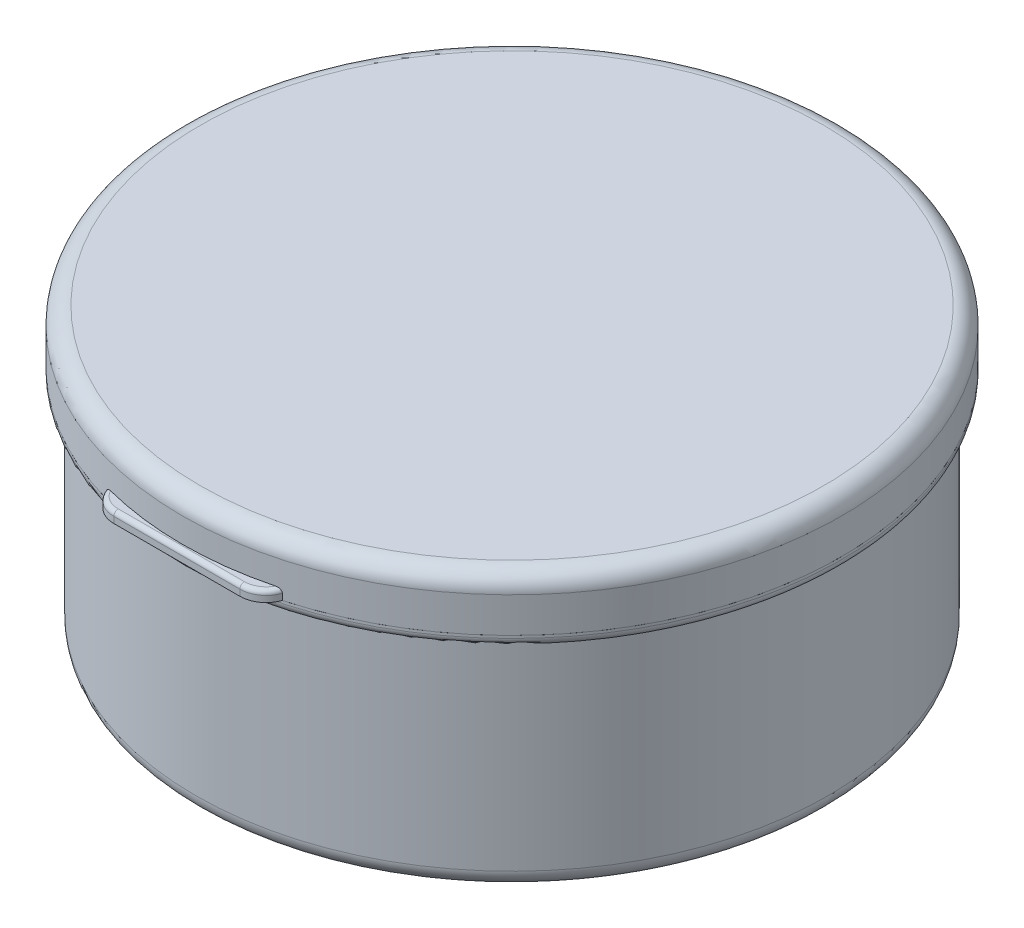
ISO-10303-21;
HEADER;
FILE_DESCRIPTION(('STEP AP214'),'2;1');
FILE_NAME('part.step','',(''),(''),'','','');
FILE_SCHEMA(('AUTOMOTIVE_DESIGN { 1 0 10303 214 1 1 1 1 }'));
ENDSEC;
DATA;
#1=APPLICATION_CONTEXT('core data for automotive mechanical design processes');
#2=APPLICATION_PROTOCOL_DEFINITION('international standard','automotive_design',2000,#1);
#3=PRODUCT_CONTEXT('',#1,'mechanical');
#4=PRODUCT('Part','Part','',(#3));
#5=PRODUCT_RELATED_PRODUCT_CATEGORY('part','',(#4));
#6=PRODUCT_DEFINITION_FORMATION('','',#4);
#7=PRODUCT_DEFINITION_CONTEXT('part definition',#1,'design');
#8=PRODUCT_DEFINITION('design','',#6,#7);
#9=PRODUCT_DEFINITION_SHAPE('','',#8);
#10=(LENGTH_UNIT() NAMED_UNIT(*) SI_UNIT(.MILLI.,.METRE.));
#11=(NAMED_UNIT(*) PLANE_ANGLE_UNIT() SI_UNIT($,.RADIAN.));
#12=(NAMED_UNIT(*) SI_UNIT($,.STERADIAN.) SOLID_ANGLE_UNIT());
#13=UNCERTAINTY_MEASURE_WITH_UNIT(LENGTH_MEASURE(1.E-05),#10,'distance_accuracy_value','');
#14=(GEOMETRIC_REPRESENTATION_CONTEXT(3) GLOBAL_UNCERTAINTY_ASSIGNED_CONTEXT((#13)) GLOBAL_UNIT_ASSIGNED_CONTEXT((#10,
#11,#12)) REPRESENTATION_CONTEXT('',''));
#15=CARTESIAN_POINT('',(0.,0.,0.));
#16=DIRECTION('',(0.,0.,1.));
#17=DIRECTION('',(1.,0.,0.));
#18=AXIS2_PLACEMENT_3D('',#15,#16,#17);
#19=CARTESIAN_POINT('',(0.,25.,0.));
#20=DIRECTION('',(0.,-1.,0.));
#21=DIRECTION('',(0.,0.,-1.));
#22=AXIS2_PLACEMENT_3D('',#19,#20,#21);
#23=CYLINDRICAL_SURFACE('',#22,36.);
#24=CARTESIAN_POINT('',(0.,2.,0.));
#25=DIRECTION('',(0.,1.,0.));
#26=DIRECTION('',(0.,0.,1.));
#27=AXIS2_PLACEMENT_3D('',#24,#25,#26);
#28=CIRCLE('',#27,36.);
#29=CARTESIAN_POINT('',(0.,2.,36.));
#30=VERTEX_POINT('',#29);
#31=EDGE_CURVE('P0_E40',#30,#30,#28,.T.);
#32=ORIENTED_EDGE('',*,*,#31,.T.);
#33=EDGE_LOOP('',(#32));
#34=FACE_BOUND('',#33,.T.);
#35=CARTESIAN_POINT('',(0.,25.,0.));
#36=DIRECTION('',(0.,1.,0.));
#37=DIRECTION('',(0.,0.,1.));
#38=AXIS2_PLACEMENT_3D('',#35,#36,#37);
#39=CIRCLE('',#38,36.);
#40=CARTESIAN_POINT('',(0.,25.,36.));
#41=VERTEX_POINT('',#40);
#42=EDGE_CURVE('P0_E56',#41,#41,#39,.T.);
#43=ORIENTED_EDGE('',*,*,#42,.F.);
#44=EDGE_LOOP('',(#43));
#45=FACE_BOUND('',#44,.T.);
#46=ADVANCED_FACE('P0_F17',(#34,#45),#23,.T.);
#47=CARTESIAN_POINT('',(0.,0.,0.));
#48=DIRECTION('',(0.,1.,0.));
#49=DIRECTION('',(0.,0.,1.));
#50=AXIS2_PLACEMENT_3D('',#47,#48,#49);
#51=PLANE('',#50);
#52=CARTESIAN_POINT('',(0.,0.,0.));
#53=DIRECTION('',(0.,1.,0.));
#54=DIRECTION('',(0.,0.,1.));
#55=AXIS2_PLACEMENT_3D('',#52,#53,#54);
#56=CIRCLE('',#55,34.);
#57=CARTESIAN_POINT('',(0.,0.,34.));
#58=VERTEX_POINT('',#57);
#59=EDGE_CURVE('P0_E37',#58,#58,#56,.F.);
#60=ORIENTED_EDGE('',*,*,#59,.T.);
#61=EDGE_LOOP('',(#60));
#62=FACE_BOUND('',#61,.T.);
#63=ADVANCED_FACE('P0_F111',(#62),#51,.F.);
#64=CARTESIAN_POINT('',(0.,26.3,0.));
#65=DIRECTION('',(0.,-1.,0.));
#66=DIRECTION('',(0.,0.,-1.));
#67=AXIS2_PLACEMENT_3D('',#64,#65,#66);
#68=CYLINDRICAL_SURFACE('',#67,37.5);
#69=CARTESIAN_POINT('',(0.,26.,0.));
#70=DIRECTION('',(0.,1.,0.));
#71=DIRECTION('',(0.,0.,1.));
#72=AXIS2_PLACEMENT_3D('',#69,#70,#71);
#73=CIRCLE('',#72,37.5);
#74=CARTESIAN_POINT('',(0.,26.,37.5));
#75=VERTEX_POINT('',#74);
#76=EDGE_CURVE('P0_E46',#75,#75,#73,.T.);
#77=ORIENTED_EDGE('',*,*,#76,.T.);
#78=EDGE_LOOP('',(#77));
#79=FACE_BOUND('',#78,.T.);
#80=CARTESIAN_POINT('',(0.,26.3,0.));
#81=DIRECTION('',(0.,1.,0.));
#82=DIRECTION('',(0.,0.,1.));
#83=AXIS2_PLACEMENT_3D('',#80,#81,#82);
#84=CIRCLE('',#83,37.5);
#85=CARTESIAN_POINT('',(0.,26.3,37.5));
#86=VERTEX_POINT('',#85);
#87=EDGE_CURVE('P0_E60',#86,#86,#84,.T.);
#88=ORIENTED_EDGE('',*,*,#87,.F.);
#89=EDGE_LOOP('',(#88));
#90=FACE_BOUND('',#89,.T.);
#91=ADVANCED_FACE('P0_F116',(#79,#90),#68,.T.);
#92=CARTESIAN_POINT('',(0.,26.3,0.));
#93=DIRECTION('',(0.,1.,0.));
#94=DIRECTION('',(0.,0.,1.));
#95=AXIS2_PLACEMENT_3D('',#92,#93,#94);
#96=PLANE('',#95);
#97=CARTESIAN_POINT('',(0.,26.3,0.));
#98=DIRECTION('',(0.,1.,0.));
#99=DIRECTION('',(0.,0.,1.));
#100=AXIS2_PLACEMENT_3D('',#97,#98,#99);
#101=CIRCLE('',#100,36.);
#102=CARTESIAN_POINT('',(0.,26.3,36.));
#103=VERTEX_POINT('',#102);
#104=EDGE_CURVE('P0_E59',#103,#103,#101,.T.);
#105=ORIENTED_EDGE('',*,*,#104,.F.);
#106=EDGE_LOOP('',(#105));
#107=FACE_BOUND('',#106,.T.);
#108=ORIENTED_EDGE('',*,*,#87,.T.);
#109=EDGE_LOOP('',(#108));
#110=FACE_BOUND('',#109,.T.);
#111=ADVANCED_FACE('P0_F123',(#107,#110),#96,.T.);
#112=CARTESIAN_POINT('',(0.,25.,0.));
#113=DIRECTION('',(0.,1.,0.));
#114=DIRECTION('',(0.,0.,1.));
#115=AXIS2_PLACEMENT_3D('',#112,#113,#114);
#116=PLANE('',#115);
#117=CARTESIAN_POINT('',(0.,25.,0.));
#118=DIRECTION('',(0.,1.,0.));
#119=DIRECTION('',(0.,0.,1.));
#120=AXIS2_PLACEMENT_3D('',#117,#118,#119);
#121=CIRCLE('',#120,36.5);
#122=CARTESIAN_POINT('',(0.,25.,36.5));
#123=VERTEX_POINT('',#122);
#124=EDGE_CURVE('P0_E43',#123,#123,#121,.F.);
#125=ORIENTED_EDGE('',*,*,#124,.T.);
#126=EDGE_LOOP('',(#125));
#127=FACE_BOUND('',#126,.T.);
#128=ORIENTED_EDGE('',*,*,#42,.T.);
#129=EDGE_LOOP('',(#128));
#130=FACE_BOUND('',#129,.T.);
#131=ADVANCED_FACE('P0_F125',(#127,#130),#116,.F.);
#132=CARTESIAN_POINT('',(0.,29.3,0.));
#133=DIRECTION('',(0.,-1.,0.));
#134=DIRECTION('',(0.,0.,-1.));
#135=AXIS2_PLACEMENT_3D('',#132,#133,#134);
#136=CYLINDRICAL_SURFACE('',#135,36.);
#137=CARTESIAN_POINT('',(0.,29.3,0.));
#138=DIRECTION('',(0.,1.,0.));
#139=DIRECTION('',(0.,0.,1.));
#140=AXIS2_PLACEMENT_3D('',#137,#138,#139);
#141=CIRCLE('',#140,36.);
#142=CARTESIAN_POINT('',(0.,29.3,36.));
#143=VERTEX_POINT('',#142);
#144=EDGE_CURVE('P0_E63',#143,#143,#141,.T.);
#145=ORIENTED_EDGE('',*,*,#144,.F.);
#146=EDGE_LOOP('',(#145));
#147=FACE_BOUND('',#146,.T.);
#148=ORIENTED_EDGE('',*,*,#104,.T.);
#149=EDGE_LOOP('',(#148));
#150=FACE_BOUND('',#149,.T.);
#151=ADVANCED_FACE('P0_F128',(#147,#150),#136,.T.);
#152=CARTESIAN_POINT('',(0.,29.8,0.));
#153=DIRECTION('',(0.,-1.,0.));
#154=DIRECTION('',(0.,0.,-1.));
#155=AXIS2_PLACEMENT_3D('',#152,#153,#154);
#156=CYLINDRICAL_SURFACE('',#155,36.05);
#157=CARTESIAN_POINT('',(0.,29.305,0.));
#158=DIRECTION('',(0.,1.,0.));
#159=DIRECTION('',(0.,0.,1.));
#160=AXIS2_PLACEMENT_3D('',#157,#158,#159);
#161=CIRCLE('',#160,36.05);
#162=CARTESIAN_POINT('',(0.,29.305,36.05));
#163=VERTEX_POINT('',#162);
#164=EDGE_CURVE('P0_E28',#163,#163,#161,.T.);
#165=ORIENTED_EDGE('',*,*,#164,.T.);
#166=EDGE_LOOP('',(#165));
#167=FACE_BOUND('',#166,.T.);
#168=CARTESIAN_POINT('',(0.,29.795,0.));
#169=DIRECTION('',(0.,1.,0.));
#170=DIRECTION('',(0.,0.,1.));
#171=AXIS2_PLACEMENT_3D('',#168,#169,#170);
#172=CIRCLE('',#171,36.05);
#173=CARTESIAN_POINT('',(0.,29.795,36.05));
#174=VERTEX_POINT('',#173);
#175=EDGE_CURVE('P0_E32',#174,#174,#172,.F.);
#176=ORIENTED_EDGE('',*,*,#175,.T.);
#177=EDGE_LOOP('',(#176));
#178=FACE_BOUND('',#177,.T.);
#179=ADVANCED_FACE('P0_F135',(#167,#178),#156,.T.);
#180=CARTESIAN_POINT('',(0.,29.8,0.));
#181=DIRECTION('',(0.,1.,0.));
#182=DIRECTION('',(0.,0.,1.));
#183=AXIS2_PLACEMENT_3D('',#180,#181,#182);
#184=PLANE('',#183);
#185=CARTESIAN_POINT('',(0.,29.8,0.));
#186=DIRECTION('',(0.,1.,0.));
#187=DIRECTION('',(0.,0.,1.));
#188=AXIS2_PLACEMENT_3D('',#185,#186,#187);
#189=CIRCLE('',#188,36.045);
#190=CARTESIAN_POINT('',(0.,29.8,36.045));
#191=VERTEX_POINT('',#190);
#192=EDGE_CURVE('P0_E11',#191,#191,#189,.T.);
#193=ORIENTED_EDGE('',*,*,#192,.T.);
#194=EDGE_LOOP('',(#193));
#195=FACE_BOUND('',#194,.T.);
#196=CARTESIAN_POINT('',(0.,29.8,0.));
#197=DIRECTION('',(0.,1.,0.));
#198=DIRECTION('',(0.,0.,1.));
#199=AXIS2_PLACEMENT_3D('',#196,#197,#198);
#200=CIRCLE('',#199,36.);
#201=CARTESIAN_POINT('',(0.,29.8,36.));
#202=VERTEX_POINT('',#201);
#203=EDGE_CURVE('P0_E55',#202,#202,#200,.T.);
#204=ORIENTED_EDGE('',*,*,#203,.F.);
#205=EDGE_LOOP('',(#204));
#206=FACE_BOUND('',#205,.T.);
#207=ADVANCED_FACE('P0_F139',(#195,#206),#184,.T.);
#208=CARTESIAN_POINT('',(0.,29.3,0.));
#209=DIRECTION('',(0.,1.,0.));
#210=DIRECTION('',(0.,0.,1.));
#211=AXIS2_PLACEMENT_3D('',#208,#209,#210);
#212=PLANE('',#211);
#213=CARTESIAN_POINT('',(0.,29.3,0.));
#214=DIRECTION('',(0.,1.,0.));
#215=DIRECTION('',(0.,0.,1.));
#216=AXIS2_PLACEMENT_3D('',#213,#214,#215);
#217=CIRCLE('',#216,36.045);
#218=CARTESIAN_POINT('',(0.,29.3,36.045));
#219=VERTEX_POINT('',#218);
#220=EDGE_CURVE('P0_E24',#219,#219,#217,.F.);
#221=ORIENTED_EDGE('',*,*,#220,.T.);
#222=EDGE_LOOP('',(#221));
#223=FACE_BOUND('',#222,.T.);
#224=ORIENTED_EDGE('',*,*,#144,.T.);
#225=EDGE_LOOP('',(#224));
#226=FACE_BOUND('',#225,.T.);
#227=ADVANCED_FACE('P0_F141',(#223,#226),#212,.F.);
#228=CARTESIAN_POINT('',(0.,31.3,0.));
#229=DIRECTION('',(0.,-1.,0.));
#230=DIRECTION('',(0.,0.,-1.));
#231=AXIS2_PLACEMENT_3D('',#228,#229,#230);
#232=CYLINDRICAL_SURFACE('',#231,36.);
#233=CARTESIAN_POINT('',(0.,30.8,0.));
#234=DIRECTION('',(0.,1.,0.));
#235=DIRECTION('',(0.,0.,1.));
#236=AXIS2_PLACEMENT_3D('',#233,#234,#235);
#237=CIRCLE('',#236,36.);
#238=CARTESIAN_POINT('',(0.,30.8,36.));
#239=VERTEX_POINT('',#238);
#240=EDGE_CURVE('P0_E49',#239,#239,#237,.F.);
#241=ORIENTED_EDGE('',*,*,#240,.T.);
#242=EDGE_LOOP('',(#241));
#243=FACE_BOUND('',#242,.T.);
#244=ORIENTED_EDGE('',*,*,#203,.T.);
#245=EDGE_LOOP('',(#244));
#246=FACE_BOUND('',#245,.T.);
#247=ADVANCED_FACE('P0_F93',(#243,#246),#232,.T.);
#248=CARTESIAN_POINT('',(0.,31.3,0.));
#249=DIRECTION('',(0.,1.,0.));
#250=DIRECTION('',(0.,0.,1.));
#251=AXIS2_PLACEMENT_3D('',#248,#249,#250);
#252=PLANE('',#251);
#253=CARTESIAN_POINT('',(0.,31.3,0.));
#254=DIRECTION('',(0.,1.,0.));
#255=DIRECTION('',(0.,0.,1.));
#256=AXIS2_PLACEMENT_3D('',#253,#254,#255);
#257=CIRCLE('',#256,35.);
#258=CARTESIAN_POINT('',(0.,31.3,35.));
#259=VERTEX_POINT('',#258);
#260=EDGE_CURVE('P0_E68',#259,#259,#257,.T.);
#261=ORIENTED_EDGE('',*,*,#260,.F.);
#262=EDGE_LOOP('',(#261));
#263=FACE_BOUND('',#262,.T.);
#264=CARTESIAN_POINT('',(0.,31.3,0.));
#265=DIRECTION('',(0.,1.,0.));
#266=DIRECTION('',(0.,0.,1.));
#267=AXIS2_PLACEMENT_3D('',#264,#265,#266);
#268=CIRCLE('',#267,35.5);
#269=CARTESIAN_POINT('',(0.,31.3,35.5));
#270=VERTEX_POINT('',#269);
#271=EDGE_CURVE('P0_E52',#270,#270,#268,.T.);
#272=ORIENTED_EDGE('',*,*,#271,.T.);
#273=EDGE_LOOP('',(#272));
#274=FACE_BOUND('',#273,.T.);
#275=ADVANCED_FACE('P0_F89',(#263,#274),#252,.T.);
#276=CARTESIAN_POINT('',(0.,30.8,0.));
#277=DIRECTION('',(0.,1.,0.));
#278=DIRECTION('',(0.,0.,1.));
#279=AXIS2_PLACEMENT_3D('',#276,#277,#278);
#280=TOROIDAL_SURFACE('',#279,35.5,0.5);
#281=ORIENTED_EDGE('',*,*,#240,.F.);
#282=EDGE_LOOP('',(#281));
#283=FACE_BOUND('',#282,.T.);
#284=ORIENTED_EDGE('',*,*,#271,.F.);
#285=EDGE_LOOP('',(#284));
#286=FACE_BOUND('',#285,.T.);
#287=ADVANCED_FACE('P0_F92',(#283,#286),#280,.T.);
#288=CARTESIAN_POINT('',(0.,26.,0.));
#289=DIRECTION('',(0.,1.,0.));
#290=DIRECTION('',(0.,0.,1.));
#291=AXIS2_PLACEMENT_3D('',#288,#289,#290);
#292=TOROIDAL_SURFACE('',#291,36.5,1.);
#293=ORIENTED_EDGE('',*,*,#124,.F.);
#294=EDGE_LOOP('',(#293));
#295=FACE_BOUND('',#294,.T.);
#296=ORIENTED_EDGE('',*,*,#76,.F.);
#297=EDGE_LOOP('',(#296));
#298=FACE_BOUND('',#297,.T.);
#299=ADVANCED_FACE('P0_F98',(#295,#298),#292,.T.);
#300=CARTESIAN_POINT('',(0.,2.,0.));
#301=DIRECTION('',(0.,1.,0.));
#302=DIRECTION('',(0.,0.,1.));
#303=AXIS2_PLACEMENT_3D('',#300,#301,#302);
#304=TOROIDAL_SURFACE('',#303,34.,2.);
#305=ORIENTED_EDGE('',*,*,#59,.F.);
#306=EDGE_LOOP('',(#305));
#307=FACE_BOUND('',#306,.T.);
#308=ORIENTED_EDGE('',*,*,#31,.F.);
#309=EDGE_LOOP('',(#308));
#310=FACE_BOUND('',#309,.T.);
#311=ADVANCED_FACE('P0_F105',(#307,#310),#304,.T.);
#312=CARTESIAN_POINT('',(0.,29.305,0.));
#313=DIRECTION('',(0.,1.,0.));
#314=DIRECTION('',(0.,0.,1.));
#315=AXIS2_PLACEMENT_3D('',#312,#313,#314);
#316=TOROIDAL_SURFACE('',#315,36.045,0.005);
#317=ORIENTED_EDGE('',*,*,#220,.F.);
#318=EDGE_LOOP('',(#317));
#319=FACE_BOUND('',#318,.T.);
#320=ORIENTED_EDGE('',*,*,#164,.F.);
#321=EDGE_LOOP('',(#320));
#322=FACE_BOUND('',#321,.T.);
#323=ADVANCED_FACE('P0_F185',(#319,#322),#316,.T.);
#324=CARTESIAN_POINT('',(0.,29.795,0.));
#325=DIRECTION('',(0.,1.,0.));
#326=DIRECTION('',(0.,0.,1.));
#327=AXIS2_PLACEMENT_3D('',#324,#325,#326);
#328=TOROIDAL_SURFACE('',#327,36.045,0.005);
#329=ORIENTED_EDGE('',*,*,#175,.F.);
#330=EDGE_LOOP('',(#329));
#331=FACE_BOUND('',#330,.T.);
#332=ORIENTED_EDGE('',*,*,#192,.F.);
#333=EDGE_LOOP('',(#332));
#334=FACE_BOUND('',#333,.T.);
#335=ADVANCED_FACE('P0_F19',(#331,#334),#328,.T.);
#336=CARTESIAN_POINT('',(0.,25.,0.));
#337=DIRECTION('',(0.,-1.,0.));
#338=DIRECTION('',(0.,0.,-1.));
#339=AXIS2_PLACEMENT_3D('',#336,#337,#338);
#340=CYLINDRICAL_SURFACE('',#339,35.);
#341=CARTESIAN_POINT('',(0.,2.,0.));
#342=DIRECTION('',(0.,-1.,0.));
#343=DIRECTION('',(0.,0.,-1.));
#344=AXIS2_PLACEMENT_3D('',#341,#342,#343);
#345=CIRCLE('',#344,35.);
#346=CARTESIAN_POINT('',(0.,2.,-35.));
#347=VERTEX_POINT('',#346);
#348=EDGE_CURVE('P0_E76',#347,#347,#345,.F.);
#349=ORIENTED_EDGE('',*,*,#348,.F.);
#350=EDGE_LOOP('',(#349));
#351=FACE_BOUND('',#350,.T.);
#352=ORIENTED_EDGE('',*,*,#260,.T.);
#353=EDGE_LOOP('',(#352));
#354=FACE_BOUND('',#353,.T.);
#355=ADVANCED_FACE('P0_F82',(#351,#354),#340,.F.);
#356=CARTESIAN_POINT('',(0.,1.,0.));
#357=DIRECTION('',(0.,1.,0.));
#358=DIRECTION('',(0.,0.,1.));
#359=AXIS2_PLACEMENT_3D('',#356,#357,#358);
#360=PLANE('',#359);
#361=CARTESIAN_POINT('',(0.,1.,0.));
#362=DIRECTION('',(0.,1.,0.));
#363=DIRECTION('',(0.,0.,1.));
#364=AXIS2_PLACEMENT_3D('',#361,#362,#363);
#365=CIRCLE('',#364,34.);
#366=CARTESIAN_POINT('',(0.,1.,34.));
#367=VERTEX_POINT('',#366);
#368=EDGE_CURVE('P0_E73',#367,#367,#365,.F.);
#369=ORIENTED_EDGE('',*,*,#368,.F.);
#370=EDGE_LOOP('',(#369));
#371=FACE_BOUND('',#370,.T.);
#372=ADVANCED_FACE('P0_F85',(#371),#360,.T.);
#373=CARTESIAN_POINT('',(0.,2.,0.));
#374=DIRECTION('',(0.,1.,0.));
#375=DIRECTION('',(0.,0.,1.));
#376=AXIS2_PLACEMENT_3D('',#373,#374,#375);
#377=TOROIDAL_SURFACE('',#376,34.,1.);
#378=ORIENTED_EDGE('',*,*,#368,.T.);
#379=EDGE_LOOP('',(#378));
#380=FACE_BOUND('',#379,.T.);
#381=ORIENTED_EDGE('',*,*,#348,.T.);
#382=EDGE_LOOP('',(#381));
#383=FACE_BOUND('',#382,.T.);
#384=ADVANCED_FACE('P0_F80',(#380,#383),#377,.F.);
#385=CLOSED_SHELL('',(#46,#63,#91,#111,#131,#151,#179,#207,#227,#247,#275,#287,#299,#311,#323,
#335,#355,#372,#384));
#386=MANIFOLD_SOLID_BREP('P0_B1',#385);
#387=CARTESIAN_POINT('',(7.5,26.3,-38.13));
#388=DIRECTION('',(0.,-1.,0.));
#389=DIRECTION('',(0.,0.,-1.));
#390=AXIS2_PLACEMENT_3D('',#387,#388,#389);
#391=PLANE('',#390);
#392=DIRECTION('',(0.,0.,1.));
#393=VECTOR('',#392,1.);
#394=CARTESIAN_POINT('',(-7.5,26.3,-38.13));
#395=LINE('',#394,#393);
#396=CARTESIAN_POINT('',(-7.5,26.3,-38.13));
#397=VERTEX_POINT('',#396);
#398=CARTESIAN_POINT('',(-7.5,26.3,-36.));
#399=VERTEX_POINT('',#398);
#400=EDGE_CURVE('P1_E74',#397,#399,#395,.T.);
#401=ORIENTED_EDGE('',*,*,#400,.T.);
#402=DIRECTION('',(-1.,0.,0.));
#403=VECTOR('',#402,1.);
#404=CARTESIAN_POINT('',(7.5,26.3,-36.));
#405=LINE('',#404,#403);
#406=CARTESIAN_POINT('',(7.5,26.3,-36.));
#407=VERTEX_POINT('',#406);
#408=EDGE_CURVE('P1_E58',#407,#399,#405,.T.);
#409=ORIENTED_EDGE('',*,*,#408,.F.);
#410=DIRECTION('',(0.,0.,1.));
#411=VECTOR('',#410,1.);
#412=CARTESIAN_POINT('',(7.5,26.3,-38.13));
#413=LINE('',#412,#411);
#414=CARTESIAN_POINT('',(7.5,26.3,-38.13));
#415=VERTEX_POINT('',#414);
#416=EDGE_CURVE('P1_E63',#415,#407,#413,.T.);
#417=ORIENTED_EDGE('',*,*,#416,.F.);
#418=DIRECTION('',(-1.,0.,0.));
#419=VECTOR('',#418,1.);
#420=CARTESIAN_POINT('',(7.5,26.3,-38.13));
#421=LINE('',#420,#419);
#422=EDGE_CURVE('P1_E76',#415,#397,#421,.T.);
#423=ORIENTED_EDGE('',*,*,#422,.T.);
#424=EDGE_LOOP('',(#401,#409,#417,#423));
#425=FACE_BOUND('',#424,.T.);
#426=ADVANCED_FACE('P1_F17',(#425),#391,.F.);
#427=CARTESIAN_POINT('',(7.5,26.3,-36.));
#428=DIRECTION('',(0.,0.,-1.));
#429=DIRECTION('',(-1.,0.,0.));
#430=AXIS2_PLACEMENT_3D('',#427,#428,#429);
#431=PLANE('',#430);
#432=DIRECTION('',(0.,-1.,0.));
#433=VECTOR('',#432,1.);
#434=CARTESIAN_POINT('',(-7.5,26.3,-36.));
#435=LINE('',#434,#433);
#436=CARTESIAN_POINT('',(-7.5,25.8909332683598,-36.));
#437=VERTEX_POINT('',#436);
#438=EDGE_CURVE('P1_E84',#399,#437,#435,.T.);
#439=ORIENTED_EDGE('',*,*,#438,.T.);
#440=DIRECTION('',(-1.,0.,0.));
#441=VECTOR('',#440,1.);
#442=CARTESIAN_POINT('',(7.5,25.8909332683598,-36.));
#443=LINE('',#442,#441);
#444=CARTESIAN_POINT('',(7.5,25.8909332683598,-36.));
#445=VERTEX_POINT('',#444);
#446=EDGE_CURVE('P1_E25',#437,#445,#443,.F.);
#447=ORIENTED_EDGE('',*,*,#446,.T.);
#448=DIRECTION('',(0.,-1.,0.));
#449=VECTOR('',#448,1.);
#450=CARTESIAN_POINT('',(7.5,26.3,-36.));
#451=LINE('',#450,#449);
#452=EDGE_CURVE('P1_E54',#407,#445,#451,.T.);
#453=ORIENTED_EDGE('',*,*,#452,.F.);
#454=ORIENTED_EDGE('',*,*,#408,.T.);
#455=EDGE_LOOP('',(#439,#447,#453,#454));
#456=FACE_BOUND('',#455,.T.);
#457=ADVANCED_FACE('P1_F56',(#456),#431,.F.);
#458=CARTESIAN_POINT('',(7.5,25.,-36.));
#459=DIRECTION('',(0.,0.8535788739892,0.520963632012187));
#460=DIRECTION('',(0.,-0.520963632012187,0.8535788739892));
#461=AXIS2_PLACEMENT_3D('',#458,#459,#460);
#462=PLANE('',#461);
#463=DIRECTION('',(0.,0.520963632012187,-0.8535788739892));
#464=VECTOR('',#463,1.);
#465=CARTESIAN_POINT('',(7.5,25.,-36.));
#466=LINE('',#465,#464);
#467=CARTESIAN_POINT('',(7.5,25.4641438313652,-36.7604818160061));
#468=VERTEX_POINT('',#467);
#469=EDGE_CURVE('P1_E62',#468,#415,#466,.T.);
#470=ORIENTED_EDGE('',*,*,#469,.F.);
#471=DIRECTION('',(-1.,0.,0.));
#472=VECTOR('',#471,1.);
#473=CARTESIAN_POINT('',(7.5,25.4641438313652,-36.7604818160061));
#474=LINE('',#473,#472);
#475=CARTESIAN_POINT('',(-7.5,25.4641438313652,-36.7604818160061));
#476=VERTEX_POINT('',#475);
#477=EDGE_CURVE('P1_E75',#468,#476,#474,.T.);
#478=ORIENTED_EDGE('',*,*,#477,.T.);
#479=DIRECTION('',(0.,0.520963632012187,-0.8535788739892));
#480=VECTOR('',#479,1.);
#481=CARTESIAN_POINT('',(-7.5,25.,-36.));
#482=LINE('',#481,#480);
#483=EDGE_CURVE('P1_E71',#476,#397,#482,.T.);
#484=ORIENTED_EDGE('',*,*,#483,.T.);
#485=ORIENTED_EDGE('',*,*,#422,.F.);
#486=EDGE_LOOP('',(#470,#478,#484,#485));
#487=FACE_BOUND('',#486,.T.);
#488=ADVANCED_FACE('P1_F90',(#487),#462,.F.);
#489=CARTESIAN_POINT('',(7.5,0.,0.));
#490=DIRECTION('',(1.,0.,0.));
#491=DIRECTION('',(0.,0.,-1.));
#492=AXIS2_PLACEMENT_3D('',#489,#490,#491);
#493=PLANE('',#492);
#494=ORIENTED_EDGE('',*,*,#452,.T.);
#495=CARTESIAN_POINT('',(7.5,25.8909332683598,-36.5));
#496=DIRECTION('',(1.,0.,0.));
#497=DIRECTION('',(0.,0.,-1.));
#498=AXIS2_PLACEMENT_3D('',#495,#496,#497);
#499=CIRCLE('',#498,0.5);
#500=EDGE_CURVE('P1_E11',#445,#468,#499,.T.);
#501=ORIENTED_EDGE('',*,*,#500,.T.);
#502=ORIENTED_EDGE('',*,*,#469,.T.);
#503=ORIENTED_EDGE('',*,*,#416,.T.);
#504=EDGE_LOOP('',(#494,#501,#502,#503));
#505=FACE_BOUND('',#504,.T.);
#506=ADVANCED_FACE('P1_F66',(#505),#493,.T.);
#507=CARTESIAN_POINT('',(-7.5,0.,0.));
#508=DIRECTION('',(1.,0.,0.));
#509=DIRECTION('',(0.,0.,-1.));
#510=AXIS2_PLACEMENT_3D('',#507,#508,#509);
#511=PLANE('',#510);
#512=ORIENTED_EDGE('',*,*,#483,.F.);
#513=CARTESIAN_POINT('',(-7.5,25.8909332683598,-36.5));
#514=DIRECTION('',(1.,0.,0.));
#515=DIRECTION('',(0.,0.,-1.));
#516=AXIS2_PLACEMENT_3D('',#513,#514,#515);
#517=CIRCLE('',#516,0.5);
#518=EDGE_CURVE('P1_E39',#476,#437,#517,.F.);
#519=ORIENTED_EDGE('',*,*,#518,.T.);
#520=ORIENTED_EDGE('',*,*,#438,.F.);
#521=ORIENTED_EDGE('',*,*,#400,.F.);
#522=EDGE_LOOP('',(#512,#519,#520,#521));
#523=FACE_BOUND('',#522,.T.);
#524=ADVANCED_FACE('P1_F91',(#523),#511,.F.);
#525=CARTESIAN_POINT('',(7.5,25.8909332683598,-36.5));
#526=DIRECTION('',(-1.,0.,0.));
#527=DIRECTION('',(0.,0.,1.));
#528=AXIS2_PLACEMENT_3D('',#525,#526,#527);
#529=CYLINDRICAL_SURFACE('',#528,0.5);
#530=ORIENTED_EDGE('',*,*,#500,.F.);
#531=ORIENTED_EDGE('',*,*,#446,.F.);
#532=ORIENTED_EDGE('',*,*,#518,.F.);
#533=ORIENTED_EDGE('',*,*,#477,.F.);
#534=EDGE_LOOP('',(#530,#531,#532,#533));
#535=FACE_BOUND('',#534,.T.);
#536=ADVANCED_FACE('P1_F19',(#535),#529,.T.);
#537=CLOSED_SHELL('',(#426,#457,#488,#506,#524,#536));
#538=MANIFOLD_SOLID_BREP('P1_B1',#537);
#539=CARTESIAN_POINT('',(0.,32.3,-0.00185199325785927));
#540=DIRECTION('',(0.,-1.,0.));
#541=DIRECTION('',(0.,0.,-1.));
#542=AXIS2_PLACEMENT_3D('',#539,#540,#541);
#543=CYLINDRICAL_SURFACE('',#542,37.5);
#544=CARTESIAN_POINT('',(0.,30.3,-0.00185199325785927));
#545=DIRECTION('',(0.,1.,0.));
#546=DIRECTION('',(0.,0.,1.));
#547=AXIS2_PLACEMENT_3D('',#544,#545,#546);
#548=CIRCLE('',#547,37.5);
#549=CARTESIAN_POINT('',(0.,30.3,37.4981480067421));
#550=VERTEX_POINT('',#549);
#551=EDGE_CURVE('P2_E126',#550,#550,#548,.F.);
#552=ORIENTED_EDGE('',*,*,#551,.T.);
#553=EDGE_LOOP('',(#552));
#554=FACE_BOUND('',#553,.T.);
#555=DIRECTION('',(0.,-1.,0.));
#556=VECTOR('',#555,1.);
#557=CARTESIAN_POINT('',(-10.,27.5,36.1402287437445));
#558=LINE('',#557,#556);
#559=CARTESIAN_POINT('',(-10.,27.,36.1402287437445));
#560=VERTEX_POINT('',#559);
#561=CARTESIAN_POINT('',(-10.,26.3,36.1402287437446));
#562=VERTEX_POINT('',#561);
#563=EDGE_CURVE('P2_E94',#560,#562,#558,.T.);
#564=ORIENTED_EDGE('',*,*,#563,.F.);
#565=CARTESIAN_POINT('',(-10.,27.,36.1402287437445));
#566=CARTESIAN_POINT('',(-10.0000382133761,27.0243756471936,36.1402174481907));
#567=CARTESIAN_POINT('',(-9.99790724430586,27.0487196386988,36.1408077840398));
#568=CARTESIAN_POINT('',(-9.98961891755113,27.096536108367,36.1430998775856));
#569=CARTESIAN_POINT('',(-9.98348200036196,27.1200123750097,36.1447959929477));
#570=CARTESIAN_POINT('',(-9.96749691123568,27.1655209678051,36.1492070414324));
#571=CARTESIAN_POINT('',(-9.95765280472308,27.1875548447714,36.1519208584964));
#572=CARTESIAN_POINT('',(-9.9347202819291,27.2297400817706,36.1582292426086));
#573=CARTESIAN_POINT('',(-9.92162839438035,27.2498893956224,36.1618247519724));
#574=CARTESIAN_POINT('',(-9.89189654229517,27.2890463807155,36.1699689800146));
#575=CARTESIAN_POINT('',(-9.87509650267637,27.3079228924983,36.1745604476678));
#576=CARTESIAN_POINT('',(-9.83907290567083,27.3429771066571,36.1843745761447));
#577=CARTESIAN_POINT('',(-9.81984953888321,27.3591550210506,36.1895971873264));
#578=CARTESIAN_POINT('',(-9.77618251241453,27.3912128399622,36.2014192070442));
#579=CARTESIAN_POINT('',(-9.75140138637767,27.4066005081986,36.2081034394526));
#580=CARTESIAN_POINT('',(-9.69997742039737,27.4337264886857,36.2219130538441));
#581=CARTESIAN_POINT('',(-9.67333009141607,27.445455603596,36.2290394944928));
#582=CARTESIAN_POINT('',(-9.60400910832047,27.4707931140333,36.2474911293713));
#583=CARTESIAN_POINT('',(-9.56049281433962,27.4819613573462,36.2589942780941));
#584=CARTESIAN_POINT('',(-9.47244354320656,27.496546851257,36.2820970876095));
#585=CARTESIAN_POINT('',(-9.42791756893757,27.5000068769216,36.2936958554615));
#586=CARTESIAN_POINT('',(-9.38357526391901,27.5,36.3051516736157));
#587=B_SPLINE_CURVE_WITH_KNOTS('',3,(#565,#566,#567,#568,#569,#570,#571,#572,#573,#574,#575,
#576,#577,#578,#579,#580,#581,#582,#583,#584,#585,#586),.UNSPECIFIED.,.F.,.F.,(4,2,2,2,2,2,2,2,
2,2,4),(0.,0.0729769961832492,0.145584505065667,0.218112620965288,0.290718592313942,
0.367476196206673,0.444227766735103,0.533678986439333,0.623353300721923,0.761739623836763,
0.899356069044244),.UNSPECIFIED.);
#588=CARTESIAN_POINT('',(-9.38357526391906,27.5,36.3051516736156));
#589=VERTEX_POINT('',#588);
#590=EDGE_CURVE('P2_E145',#560,#589,#587,.T.);
#591=ORIENTED_EDGE('',*,*,#590,.T.);
#592=CARTESIAN_POINT('',(0.,27.5,-0.00185199325785927));
#593=DIRECTION('',(0.,-1.,0.));
#594=DIRECTION('',(0.,0.,-1.));
#595=AXIS2_PLACEMENT_3D('',#592,#593,#594);
#596=CIRCLE('',#595,37.5);
#597=CARTESIAN_POINT('',(9.38357526391905,27.5,36.3051516736156));
#598=VERTEX_POINT('',#597);
#599=EDGE_CURVE('P2_E95',#598,#589,#596,.T.);
#600=ORIENTED_EDGE('',*,*,#599,.F.);
#601=CARTESIAN_POINT('',(9.38357526391899,27.5,36.3051516736157));
#602=CARTESIAN_POINT('',(9.42428679601337,27.4999989566077,36.2946327330455));
#603=CARTESIAN_POINT('',(9.46510889740142,27.4970900647726,36.2840062904106));
#604=CARTESIAN_POINT('',(9.5461248199382,27.4848583085873,36.2627755362314));
#605=CARTESIAN_POINT('',(9.58631099349495,27.4754842752286,36.2521720831384));
#606=CARTESIAN_POINT('',(9.65779690666299,27.4519206115842,36.2331876140266));
#607=CARTESIAN_POINT('',(9.68943708514713,27.4388352159252,36.22473778891));
#608=CARTESIAN_POINT('',(9.75019913473441,27.4076047477719,36.2084310428087));
#609=CARTESIAN_POINT('',(9.77932879582767,27.3894761233335,36.2005722981672));
#610=CARTESIAN_POINT('',(9.82905747870081,27.3517733741727,36.187098974022));
#611=CARTESIAN_POINT('',(9.85025020464957,27.3330385888595,36.1813344720361));
#612=CARTESIAN_POINT('',(9.88939992250501,27.2921906908413,36.1706538735575));
#613=CARTESIAN_POINT('',(9.90735596713974,27.2700765926084,36.165738025456));
#614=CARTESIAN_POINT('',(9.93926934175458,27.2226414642323,36.1569809874547));
#615=CARTESIAN_POINT('',(9.95319244332415,27.1972954708715,36.1531490026127));
#616=CARTESIAN_POINT('',(9.97594099331427,27.1442676851884,36.1468788679044));
#617=CARTESIAN_POINT('',(9.98477742611904,27.1165910750943,36.1444377147307));
#618=CARTESIAN_POINT('',(9.99381838812078,27.0738043481456,36.1419386683202));
#619=CARTESIAN_POINT('',(9.99613093850081,27.0591471345923,36.1412990908644));
#620=CARTESIAN_POINT('',(9.99922273455766,27.0296637531308,36.1404438087953));
#621=CARTESIAN_POINT('',(10.000002373144,27.0148376294969,36.1402279955646));
#622=CARTESIAN_POINT('',(10.,27.,36.1402287437446));
#623=B_SPLINE_CURVE_WITH_KNOTS('',3,(#601,#602,#603,#604,#605,#606,#607,#608,#609,#610,#611,
#612,#613,#614,#615,#616,#617,#618,#619,#620,#621,#622),.UNSPECIFIED.,.F.,.F.,(4,2,2,2,2,2,2,2,
2,2,4),(0.,0.126260985439893,0.253532919301127,0.358935762270581,0.463998793729603,
0.5502590433249,0.636544497660432,0.723542146131535,0.810351216275184,0.854831538096251,
0.899300457421238),.UNSPECIFIED.);
#624=CARTESIAN_POINT('',(10.,27.,36.1402287437445));
#625=VERTEX_POINT('',#624);
#626=EDGE_CURVE('P2_E33',#598,#625,#623,.T.);
#627=ORIENTED_EDGE('',*,*,#626,.T.);
#628=DIRECTION('',(0.,-1.,0.));
#629=VECTOR('',#628,1.);
#630=CARTESIAN_POINT('',(10.,27.5,36.1402287437445));
#631=LINE('',#630,#629);
#632=CARTESIAN_POINT('',(10.,26.3,36.1402287437445));
#633=VERTEX_POINT('',#632);
#634=EDGE_CURVE('P2_E88',#625,#633,#631,.T.);
#635=ORIENTED_EDGE('',*,*,#634,.T.);
#636=CARTESIAN_POINT('',(0.,26.3,-0.00185199325785927));
#637=DIRECTION('',(0.,1.,0.));
#638=DIRECTION('',(0.,0.,1.));
#639=AXIS2_PLACEMENT_3D('',#636,#637,#638);
#640=CIRCLE('',#639,37.5);
#641=CARTESIAN_POINT('',(7.5,26.3,-36.7441981350055));
#642=VERTEX_POINT('',#641);
#643=EDGE_CURVE('P2_E92',#633,#642,#640,.T.);
#644=ORIENTED_EDGE('',*,*,#643,.T.);
#645=DIRECTION('',(0.,-1.,0.));
#646=VECTOR('',#645,1.);
#647=CARTESIAN_POINT('',(7.5,32.3,-36.7441981350055));
#648=LINE('',#647,#646);
#649=CARTESIAN_POINT('',(7.5,27.2703489123342,-36.7441981350055));
#650=VERTEX_POINT('',#649);
#651=EDGE_CURVE('P2_E365',#642,#650,#648,.F.);
#652=ORIENTED_EDGE('',*,*,#651,.T.);
#653=CARTESIAN_POINT('',(0.,52.997616652296,-0.00185199325785927));
#654=DIRECTION('',(0.,-0.819152044288995,0.573576436351041));
#655=DIRECTION('',(0.,-0.573576436351041,-0.819152044288995));
#656=AXIS2_PLACEMENT_3D('',#653,#654,#655);
#657=ELLIPSE('',#656,45.7790470785544,37.5);
#658=CARTESIAN_POINT('',(-7.5,27.2703489123342,-36.7441981350055));
#659=VERTEX_POINT('',#658);
#660=EDGE_CURVE('P2_E115',#659,#650,#657,.T.);
#661=ORIENTED_EDGE('',*,*,#660,.F.);
#662=DIRECTION('',(0.,-1.,0.));
#663=VECTOR('',#662,1.);
#664=CARTESIAN_POINT('',(-7.5,32.3,-36.7441981350055));
#665=LINE('',#664,#663);
#666=CARTESIAN_POINT('',(-7.5,26.3,-36.7441981350055));
#667=VERTEX_POINT('',#666);
#668=EDGE_CURVE('P2_E362',#667,#659,#665,.F.);
#669=ORIENTED_EDGE('',*,*,#668,.F.);
#670=EDGE_CURVE('P2_E111',#667,#562,#640,.T.);
#671=ORIENTED_EDGE('',*,*,#670,.T.);
#672=EDGE_LOOP('',(#564,#591,#600,#627,#635,#644,#652,#661,#669,#671));
#673=FACE_BOUND('',#672,.T.);
#674=ADVANCED_FACE('P2_F18',(#554,#673),#543,.T.);
#675=CARTESIAN_POINT('',(0.,32.3,-0.00185199325785927));
#676=DIRECTION('',(0.,1.,0.));
#677=DIRECTION('',(0.,0.,1.));
#678=AXIS2_PLACEMENT_3D('',#675,#676,#677);
#679=PLANE('',#678);
#680=CARTESIAN_POINT('',(0.,32.3,-0.00185199325785927));
#681=DIRECTION('',(0.,1.,0.));
#682=DIRECTION('',(0.,0.,1.));
#683=AXIS2_PLACEMENT_3D('',#680,#681,#682);
#684=CIRCLE('',#683,35.5);
#685=CARTESIAN_POINT('',(0.,32.3,35.4981480067421));
#686=VERTEX_POINT('',#685);
#687=EDGE_CURVE('P2_E123',#686,#686,#684,.T.);
#688=ORIENTED_EDGE('',*,*,#687,.T.);
#689=EDGE_LOOP('',(#688));
#690=FACE_BOUND('',#689,.T.);
#691=ADVANCED_FACE('P2_F182',(#690),#679,.T.);
#692=CARTESIAN_POINT('',(0.,26.3,-0.00185199325785927));
#693=DIRECTION('',(0.,1.,0.));
#694=DIRECTION('',(0.,0.,1.));
#695=AXIS2_PLACEMENT_3D('',#692,#693,#694);
#696=PLANE('',#695);
#697=ORIENTED_EDGE('',*,*,#643,.F.);
#698=CARTESIAN_POINT('',(7.17157287525381,26.3,35.1402287437445));
#699=DIRECTION('',(0.,1.,0.));
#700=DIRECTION('',(0.,0.,1.));
#701=AXIS2_PLACEMENT_3D('',#698,#699,#700);
#702=CIRCLE('',#701,3.);
#703=CARTESIAN_POINT('',(7.17157287525381,26.3,38.1402287437445));
#704=VERTEX_POINT('',#703);
#705=EDGE_CURVE('P2_E97',#633,#704,#702,.F.);
#706=ORIENTED_EDGE('',*,*,#705,.T.);
#707=DIRECTION('',(1.,0.,0.));
#708=VECTOR('',#707,1.);
#709=CARTESIAN_POINT('',(0.,26.3,38.1402287437445));
#710=LINE('',#709,#708);
#711=CARTESIAN_POINT('',(-7.17157287525382,26.3,38.1402287437445));
#712=VERTEX_POINT('',#711);
#713=EDGE_CURVE('P2_E336',#712,#704,#710,.T.);
#714=ORIENTED_EDGE('',*,*,#713,.F.);
#715=CARTESIAN_POINT('',(-7.17157287525382,26.3,35.1402287437445));
#716=DIRECTION('',(0.,1.,0.));
#717=DIRECTION('',(0.,0.,1.));
#718=AXIS2_PLACEMENT_3D('',#715,#716,#717);
#719=CIRCLE('',#718,3.);
#720=EDGE_CURVE('P2_E104',#712,#562,#719,.F.);
#721=ORIENTED_EDGE('',*,*,#720,.T.);
#722=ORIENTED_EDGE('',*,*,#670,.F.);
#723=DIRECTION('',(0.,0.,-1.));
#724=VECTOR('',#723,1.);
#725=CARTESIAN_POINT('',(-7.5,26.3,-36.7018519932579));
#726=LINE('',#725,#724);
#727=CARTESIAN_POINT('',(-7.5,26.3,-38.13));
#728=VERTEX_POINT('',#727);
#729=EDGE_CURVE('P2_E349',#667,#728,#726,.T.);
#730=ORIENTED_EDGE('',*,*,#729,.T.);
#731=DIRECTION('',(-1.,0.,0.));
#732=VECTOR('',#731,1.);
#733=CARTESIAN_POINT('',(7.5,26.3,-38.13));
#734=LINE('',#733,#732);
#735=CARTESIAN_POINT('',(7.5,26.3,-38.13));
#736=VERTEX_POINT('',#735);
#737=EDGE_CURVE('P2_E356',#736,#728,#734,.T.);
#738=ORIENTED_EDGE('',*,*,#737,.F.);
#739=DIRECTION('',(0.,0.,-1.));
#740=VECTOR('',#739,1.);
#741=CARTESIAN_POINT('',(7.5,26.3,-36.7018519932579));
#742=LINE('',#741,#740);
#743=EDGE_CURVE('P2_E110',#642,#736,#742,.T.);
#744=ORIENTED_EDGE('',*,*,#743,.F.);
#745=EDGE_LOOP('',(#697,#706,#714,#721,#722,#730,#738,#744));
#746=FACE_BOUND('',#745,.T.);
#747=CARTESIAN_POINT('',(0.,26.3,-0.00185199325785927));
#748=DIRECTION('',(0.,-1.,0.));
#749=DIRECTION('',(0.,0.,-1.));
#750=AXIS2_PLACEMENT_3D('',#747,#748,#749);
#751=CIRCLE('',#750,36.5);
#752=CARTESIAN_POINT('',(0.,26.3,-36.5018519932579));
#753=VERTEX_POINT('',#752);
#754=EDGE_CURVE('P2_E117',#753,#753,#751,.T.);
#755=ORIENTED_EDGE('',*,*,#754,.F.);
#756=EDGE_LOOP('',(#755));
#757=FACE_BOUND('',#756,.T.);
#758=ADVANCED_FACE('P2_F107',(#746,#757),#696,.F.);
#759=CARTESIAN_POINT('',(0.,27.8,-0.00185199325785927));
#760=DIRECTION('',(0.,-1.,0.));
#761=DIRECTION('',(0.,0.,-1.));
#762=AXIS2_PLACEMENT_3D('',#759,#760,#761);
#763=CYLINDRICAL_SURFACE('',#762,36.5);
#764=CARTESIAN_POINT('',(0.,27.8,-0.00185199325785927));
#765=DIRECTION('',(0.,-1.,0.));
#766=DIRECTION('',(0.,0.,-1.));
#767=AXIS2_PLACEMENT_3D('',#764,#765,#766);
#768=CIRCLE('',#767,36.5);
#769=CARTESIAN_POINT('',(0.,27.8,-36.5018519932579));
#770=VERTEX_POINT('',#769);
#771=EDGE_CURVE('P2_E112',#770,#770,#768,.T.);
#772=ORIENTED_EDGE('',*,*,#771,.F.);
#773=EDGE_LOOP('',(#772));
#774=FACE_BOUND('',#773,.T.);
#775=ORIENTED_EDGE('',*,*,#754,.T.);
#776=EDGE_LOOP('',(#775));
#777=FACE_BOUND('',#776,.T.);
#778=ADVANCED_FACE('P2_F233',(#774,#777),#763,.F.);
#779=CARTESIAN_POINT('',(0.,27.8,-0.00185199325785927));
#780=DIRECTION('',(0.,-1.,0.));
#781=DIRECTION('',(0.,0.,-1.));
#782=AXIS2_PLACEMENT_3D('',#779,#780,#781);
#783=PLANE('',#782);
#784=CARTESIAN_POINT('',(0.,27.8,-0.00185199325785927));
#785=DIRECTION('',(0.,-1.,0.));
#786=DIRECTION('',(0.,0.,-1.));
#787=AXIS2_PLACEMENT_3D('',#784,#785,#786);
#788=CIRCLE('',#787,36.);
#789=CARTESIAN_POINT('',(0.,27.8,-36.0018519932579));
#790=VERTEX_POINT('',#789);
#791=EDGE_CURVE('P2_E367',#790,#790,#788,.T.);
#792=ORIENTED_EDGE('',*,*,#791,.F.);
#793=EDGE_LOOP('',(#792));
#794=FACE_BOUND('',#793,.T.);
#795=ORIENTED_EDGE('',*,*,#771,.T.);
#796=EDGE_LOOP('',(#795));
#797=FACE_BOUND('',#796,.T.);
#798=ADVANCED_FACE('P2_F229',(#794,#797),#783,.T.);
#799=CARTESIAN_POINT('',(0.,31.3,-0.00185199325785927));
#800=DIRECTION('',(0.,-1.,0.));
#801=DIRECTION('',(0.,0.,-1.));
#802=AXIS2_PLACEMENT_3D('',#799,#800,#801);
#803=CYLINDRICAL_SURFACE('',#802,36.);
#804=CARTESIAN_POINT('',(0.,30.8,-0.00185199325785927));
#805=DIRECTION('',(0.,-1.,0.));
#806=DIRECTION('',(0.,0.,-1.));
#807=AXIS2_PLACEMENT_3D('',#804,#805,#806);
#808=CIRCLE('',#807,36.);
#809=CARTESIAN_POINT('',(0.,30.8,-36.0018519932579));
#810=VERTEX_POINT('',#809);
#811=EDGE_CURVE('P2_E11',#810,#810,#808,.F.);
#812=ORIENTED_EDGE('',*,*,#811,.T.);
#813=EDGE_LOOP('',(#812));
#814=FACE_BOUND('',#813,.T.);
#815=ORIENTED_EDGE('',*,*,#791,.T.);
#816=EDGE_LOOP('',(#815));
#817=FACE_BOUND('',#816,.T.);
#818=ADVANCED_FACE('P2_F225',(#814,#817),#803,.F.);
#819=CARTESIAN_POINT('',(0.,31.3,-0.00185199325785927));
#820=DIRECTION('',(0.,-1.,0.));
#821=DIRECTION('',(0.,0.,-1.));
#822=AXIS2_PLACEMENT_3D('',#819,#820,#821);
#823=PLANE('',#822);
#824=CARTESIAN_POINT('',(0.,31.3,-0.00185199325785927));
#825=DIRECTION('',(0.,-1.,0.));
#826=DIRECTION('',(0.,0.,-1.));
#827=AXIS2_PLACEMENT_3D('',#824,#825,#826);
#828=CIRCLE('',#827,35.5);
#829=CARTESIAN_POINT('',(0.,31.3,-35.5018519932579));
#830=VERTEX_POINT('',#829);
#831=EDGE_CURVE('P2_E26',#830,#830,#828,.T.);
#832=ORIENTED_EDGE('',*,*,#831,.T.);
#833=EDGE_LOOP('',(#832));
#834=FACE_BOUND('',#833,.T.);
#835=ADVANCED_FACE('P2_F215',(#834),#823,.T.);
#836=CARTESIAN_POINT('',(7.5,26.3,-0.00185199325785927));
#837=DIRECTION('',(1.,0.,0.));
#838=DIRECTION('',(0.,0.,-1.));
#839=AXIS2_PLACEMENT_3D('',#836,#837,#838);
#840=PLANE('',#839);
#841=ORIENTED_EDGE('',*,*,#651,.F.);
#842=ORIENTED_EDGE('',*,*,#743,.T.);
#843=DIRECTION('',(0.,0.573576436351041,0.819152044288995));
#844=VECTOR('',#843,1.);
#845=CARTESIAN_POINT('',(7.5,26.3,-38.13));
#846=LINE('',#845,#844);
#847=EDGE_CURVE('P2_E352',#736,#650,#846,.T.);
#848=ORIENTED_EDGE('',*,*,#847,.T.);
#849=EDGE_LOOP('',(#841,#842,#848));
#850=FACE_BOUND('',#849,.T.);
#851=ADVANCED_FACE('P2_F211',(#850),#840,.T.);
#852=CARTESIAN_POINT('',(-7.5,26.3,-0.00185199325785927));
#853=DIRECTION('',(1.,0.,0.));
#854=DIRECTION('',(0.,0.,-1.));
#855=AXIS2_PLACEMENT_3D('',#852,#853,#854);
#856=PLANE('',#855);
#857=ORIENTED_EDGE('',*,*,#729,.F.);
#858=ORIENTED_EDGE('',*,*,#668,.T.);
#859=DIRECTION('',(0.,0.573576436351041,0.819152044288995));
#860=VECTOR('',#859,1.);
#861=CARTESIAN_POINT('',(-7.5,26.3,-38.13));
#862=LINE('',#861,#860);
#863=EDGE_CURVE('P2_E353',#728,#659,#862,.T.);
#864=ORIENTED_EDGE('',*,*,#863,.F.);
#865=EDGE_LOOP('',(#857,#858,#864));
#866=FACE_BOUND('',#865,.T.);
#867=ADVANCED_FACE('P2_F214',(#866),#856,.F.);
#868=CARTESIAN_POINT('',(7.5,26.3,-38.13));
#869=DIRECTION('',(0.,-0.819152044288995,0.573576436351041));
#870=DIRECTION('',(0.,-0.573576436351041,-0.819152044288995));
#871=AXIS2_PLACEMENT_3D('',#868,#869,#870);
#872=PLANE('',#871);
#873=ORIENTED_EDGE('',*,*,#863,.T.);
#874=ORIENTED_EDGE('',*,*,#660,.T.);
#875=ORIENTED_EDGE('',*,*,#847,.F.);
#876=ORIENTED_EDGE('',*,*,#737,.T.);
#877=EDGE_LOOP('',(#873,#874,#875,#876));
#878=FACE_BOUND('',#877,.T.);
#879=ADVANCED_FACE('P2_F206',(#878),#872,.F.);
#880=CARTESIAN_POINT('',(0.,27.5,38.1402287437445));
#881=DIRECTION('',(0.,0.,-1.));
#882=DIRECTION('',(-1.,0.,0.));
#883=AXIS2_PLACEMENT_3D('',#880,#881,#882);
#884=PLANE('',#883);
#885=DIRECTION('',(0.,-1.,0.));
#886=VECTOR('',#885,1.);
#887=CARTESIAN_POINT('',(7.17157287525381,27.5,38.1402287437445));
#888=LINE('',#887,#886);
#889=CARTESIAN_POINT('',(7.17157287525381,27.,38.1402287437445));
#890=VERTEX_POINT('',#889);
#891=EDGE_CURVE('P2_E99',#704,#890,#888,.F.);
#892=ORIENTED_EDGE('',*,*,#891,.T.);
#893=DIRECTION('',(1.,0.,0.));
#894=VECTOR('',#893,1.);
#895=CARTESIAN_POINT('',(0.,27.,38.1402287437445));
#896=LINE('',#895,#894);
#897=CARTESIAN_POINT('',(-7.17157287525382,27.,38.1402287437445));
#898=VERTEX_POINT('',#897);
#899=EDGE_CURVE('P2_E143',#890,#898,#896,.F.);
#900=ORIENTED_EDGE('',*,*,#899,.T.);
#901=DIRECTION('',(0.,-1.,0.));
#902=VECTOR('',#901,1.);
#903=CARTESIAN_POINT('',(-7.17157287525382,27.5,38.1402287437445));
#904=LINE('',#903,#902);
#905=EDGE_CURVE('P2_E103',#898,#712,#904,.T.);
#906=ORIENTED_EDGE('',*,*,#905,.T.);
#907=ORIENTED_EDGE('',*,*,#713,.T.);
#908=EDGE_LOOP('',(#892,#900,#906,#907));
#909=FACE_BOUND('',#908,.T.);
#910=ADVANCED_FACE('P2_F200',(#909),#884,.F.);
#911=CARTESIAN_POINT('',(0.,27.5,-0.00185199325785927));
#912=DIRECTION('',(0.,-1.,0.));
#913=DIRECTION('',(0.,0.,-1.));
#914=AXIS2_PLACEMENT_3D('',#911,#912,#913);
#915=PLANE('',#914);
#916=ORIENTED_EDGE('',*,*,#599,.T.);
#917=CARTESIAN_POINT('',(-7.17157287525382,27.5,35.1402287437445));
#918=DIRECTION('',(0.,-1.,0.));
#919=DIRECTION('',(0.,0.,-1.));
#920=AXIS2_PLACEMENT_3D('',#917,#918,#919);
#921=CIRCLE('',#920,2.5);
#922=CARTESIAN_POINT('',(-7.17157287525382,27.5,37.6402287437445));
#923=VERTEX_POINT('',#922);
#924=EDGE_CURVE('P2_E137',#589,#923,#921,.F.);
#925=ORIENTED_EDGE('',*,*,#924,.T.);
#926=DIRECTION('',(1.,0.,0.));
#927=VECTOR('',#926,1.);
#928=CARTESIAN_POINT('',(0.,27.5,37.6402287437445));
#929=LINE('',#928,#927);
#930=CARTESIAN_POINT('',(7.17157287525381,27.5,37.6402287437445));
#931=VERTEX_POINT('',#930);
#932=EDGE_CURVE('P2_E133',#923,#931,#929,.T.);
#933=ORIENTED_EDGE('',*,*,#932,.T.);
#934=CARTESIAN_POINT('',(7.17157287525381,27.5,35.1402287437445));
#935=DIRECTION('',(0.,-1.,0.));
#936=DIRECTION('',(0.,0.,-1.));
#937=AXIS2_PLACEMENT_3D('',#934,#935,#936);
#938=CIRCLE('',#937,2.5);
#939=EDGE_CURVE('P2_E135',#931,#598,#938,.F.);
#940=ORIENTED_EDGE('',*,*,#939,.T.);
#941=EDGE_LOOP('',(#916,#925,#933,#940));
#942=FACE_BOUND('',#941,.T.);
#943=ADVANCED_FACE('P2_F194',(#942),#915,.F.);
#944=CARTESIAN_POINT('',(0.,30.3,-0.00185199325785927));
#945=DIRECTION('',(0.,1.,0.));
#946=DIRECTION('',(0.,0.,1.));
#947=AXIS2_PLACEMENT_3D('',#944,#945,#946);
#948=TOROIDAL_SURFACE('',#947,35.5,2.);
#949=ORIENTED_EDGE('',*,*,#551,.F.);
#950=EDGE_LOOP('',(#949));
#951=FACE_BOUND('',#950,.T.);
#952=ORIENTED_EDGE('',*,*,#687,.F.);
#953=EDGE_LOOP('',(#952));
#954=FACE_BOUND('',#953,.T.);
#955=ADVANCED_FACE('P2_F191',(#951,#954),#948,.T.);
#956=CARTESIAN_POINT('',(7.17157287525381,32.3,35.1402287437445));
#957=DIRECTION('',(0.,-1.,0.));
#958=DIRECTION('',(0.,0.,-1.));
#959=AXIS2_PLACEMENT_3D('',#956,#957,#958);
#960=CYLINDRICAL_SURFACE('',#959,3.);
#961=ORIENTED_EDGE('',*,*,#634,.F.);
#962=CARTESIAN_POINT('',(7.17157287525381,27.,35.1402287437445));
#963=DIRECTION('',(0.,-1.,0.));
#964=DIRECTION('',(0.,0.,-1.));
#965=AXIS2_PLACEMENT_3D('',#962,#963,#964);
#966=CIRCLE('',#965,3.);
#967=EDGE_CURVE('P2_E40',#625,#890,#966,.T.);
#968=ORIENTED_EDGE('',*,*,#967,.T.);
#969=ORIENTED_EDGE('',*,*,#891,.F.);
#970=ORIENTED_EDGE('',*,*,#705,.F.);
#971=EDGE_LOOP('',(#961,#968,#969,#970));
#972=FACE_BOUND('',#971,.T.);
#973=ADVANCED_FACE('P2_F98',(#972),#960,.T.);
#974=CARTESIAN_POINT('',(-7.17157287525382,32.3,35.1402287437445));
#975=DIRECTION('',(0.,-1.,0.));
#976=DIRECTION('',(0.,0.,-1.));
#977=AXIS2_PLACEMENT_3D('',#974,#975,#976);
#978=CYLINDRICAL_SURFACE('',#977,3.);
#979=ORIENTED_EDGE('',*,*,#905,.F.);
#980=CARTESIAN_POINT('',(-7.17157287525382,27.,35.1402287437445));
#981=DIRECTION('',(0.,-1.,0.));
#982=DIRECTION('',(0.,0.,-1.));
#983=AXIS2_PLACEMENT_3D('',#980,#981,#982);
#984=CIRCLE('',#983,3.);
#985=EDGE_CURVE('P2_E140',#898,#560,#984,.T.);
#986=ORIENTED_EDGE('',*,*,#985,.T.);
#987=ORIENTED_EDGE('',*,*,#563,.T.);
#988=ORIENTED_EDGE('',*,*,#720,.F.);
#989=EDGE_LOOP('',(#979,#986,#987,#988));
#990=FACE_BOUND('',#989,.T.);
#991=ADVANCED_FACE('P2_F168',(#990),#978,.T.);
#992=CARTESIAN_POINT('',(7.17157287525381,27.,35.1402287437445));
#993=DIRECTION('',(0.,-1.,0.));
#994=DIRECTION('',(0.,0.,-1.));
#995=AXIS2_PLACEMENT_3D('',#992,#993,#994);
#996=TOROIDAL_SURFACE('',#995,2.5,0.5);
#997=ORIENTED_EDGE('',*,*,#626,.F.);
#998=ORIENTED_EDGE('',*,*,#939,.F.);
#999=CARTESIAN_POINT('',(7.17157287525381,27.,37.6402287437445));
#1000=DIRECTION('',(-1.,0.,0.));
#1001=DIRECTION('',(0.,0.,1.));
#1002=AXIS2_PLACEMENT_3D('',#999,#1000,#1001);
#1003=CIRCLE('',#1002,0.5);
#1004=EDGE_CURVE('P2_E334',#890,#931,#1003,.T.);
#1005=ORIENTED_EDGE('',*,*,#1004,.F.);
#1006=ORIENTED_EDGE('',*,*,#967,.F.);
#1007=EDGE_LOOP('',(#997,#998,#1005,#1006));
#1008=FACE_BOUND('',#1007,.T.);
#1009=ADVANCED_FACE('P2_F171',(#1008),#996,.T.);
#1010=CARTESIAN_POINT('',(0.,27.,37.6402287437445));
#1011=DIRECTION('',(1.,0.,0.));
#1012=DIRECTION('',(0.,0.,-1.));
#1013=AXIS2_PLACEMENT_3D('',#1010,#1011,#1012);
#1014=CYLINDRICAL_SURFACE('',#1013,0.5);
#1015=ORIENTED_EDGE('',*,*,#1004,.T.);
#1016=ORIENTED_EDGE('',*,*,#932,.F.);
#1017=CARTESIAN_POINT('',(-7.17157287525382,27.,37.6402287437445));
#1018=DIRECTION('',(-1.,0.,0.));
#1019=DIRECTION('',(0.,0.,1.));
#1020=AXIS2_PLACEMENT_3D('',#1017,#1018,#1019);
#1021=CIRCLE('',#1020,0.5);
#1022=EDGE_CURVE('P2_E337',#898,#923,#1021,.T.);
#1023=ORIENTED_EDGE('',*,*,#1022,.F.);
#1024=ORIENTED_EDGE('',*,*,#899,.F.);
#1025=EDGE_LOOP('',(#1015,#1016,#1023,#1024));
#1026=FACE_BOUND('',#1025,.T.);
#1027=ADVANCED_FACE('P2_F166',(#1026),#1014,.T.);
#1028=CARTESIAN_POINT('',(-7.17157287525382,27.,35.1402287437445));
#1029=DIRECTION('',(0.,-1.,0.));
#1030=DIRECTION('',(0.,0.,-1.));
#1031=AXIS2_PLACEMENT_3D('',#1028,#1029,#1030);
#1032=TOROIDAL_SURFACE('',#1031,2.5,0.5);
#1033=ORIENTED_EDGE('',*,*,#590,.F.);
#1034=ORIENTED_EDGE('',*,*,#985,.F.);
#1035=ORIENTED_EDGE('',*,*,#1022,.T.);
#1036=ORIENTED_EDGE('',*,*,#924,.F.);
#1037=EDGE_LOOP('',(#1033,#1034,#1035,#1036));
#1038=FACE_BOUND('',#1037,.T.);
#1039=ADVANCED_FACE('P2_F161',(#1038),#1032,.T.);
#1040=CARTESIAN_POINT('',(0.,30.8,-0.00185199325785927));
#1041=DIRECTION('',(0.,-1.,0.));
#1042=DIRECTION('',(0.,0.,-1.));
#1043=AXIS2_PLACEMENT_3D('',#1040,#1041,#1042);
#1044=TOROIDAL_SURFACE('',#1043,35.5,0.5);
#1045=ORIENTED_EDGE('',*,*,#811,.F.);
#1046=EDGE_LOOP('',(#1045));
#1047=FACE_BOUND('',#1046,.T.);
#1048=ORIENTED_EDGE('',*,*,#831,.F.);
#1049=EDGE_LOOP('',(#1048));
#1050=FACE_BOUND('',#1049,.T.);
#1051=ADVANCED_FACE('P2_F20',(#1047,#1050),#1044,.F.);
#1052=CLOSED_SHELL('',(#674,#691,#758,#778,#798,#818,#835,#851,#867,#879,#910,#943,#955,#973,
#991,#1009,#1027,#1039,#1051));
#1053=MANIFOLD_SOLID_BREP('P2_B1',#1052);
#1054=ADVANCED_BREP_SHAPE_REPRESENTATION('',(#18,#386,#538,#1053),#14);
#1055=SHAPE_DEFINITION_REPRESENTATION(#9,#1054);
ENDSEC;
END-ISO-10303-21;
